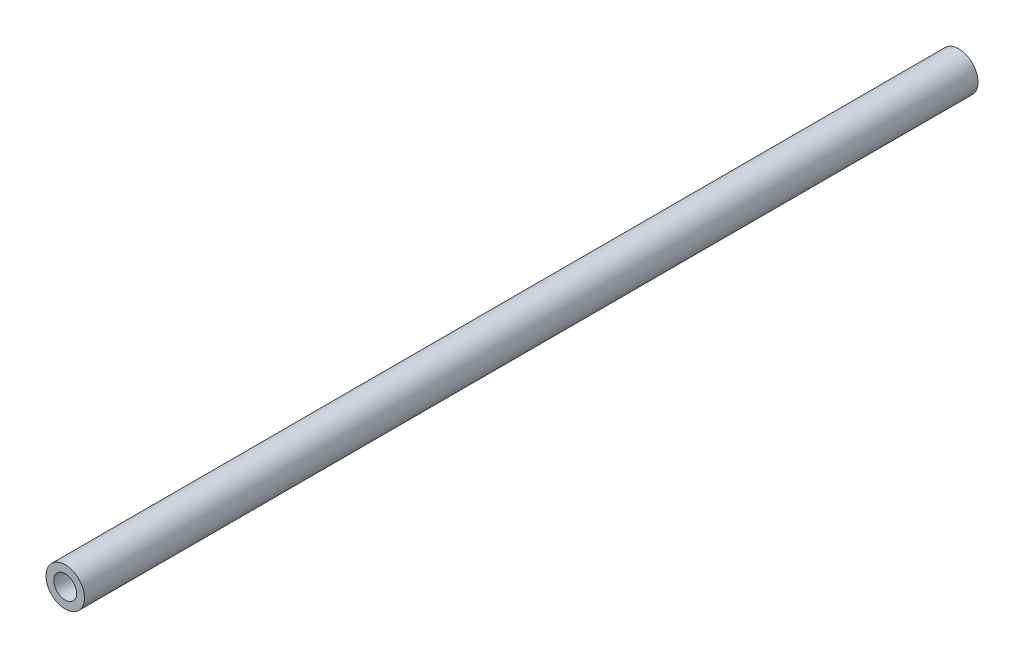
ISO-10303-21;
HEADER;
FILE_DESCRIPTION(('STEP AP214'),'2;1');
FILE_NAME('part.step','',(''),(''),'','','');
FILE_SCHEMA(('AUTOMOTIVE_DESIGN { 1 0 10303 214 1 1 1 1 }'));
ENDSEC;
DATA;
#1=APPLICATION_CONTEXT('core data for automotive mechanical design processes');
#2=APPLICATION_PROTOCOL_DEFINITION('international standard','automotive_design',2000,#1);
#3=PRODUCT_CONTEXT('',#1,'mechanical');
#4=PRODUCT('Part','Part','',(#3));
#5=PRODUCT_RELATED_PRODUCT_CATEGORY('part','',(#4));
#6=PRODUCT_DEFINITION_FORMATION('','',#4);
#7=PRODUCT_DEFINITION_CONTEXT('part definition',#1,'design');
#8=PRODUCT_DEFINITION('design','',#6,#7);
#9=PRODUCT_DEFINITION_SHAPE('','',#8);
#10=(LENGTH_UNIT() NAMED_UNIT(*) SI_UNIT(.MILLI.,.METRE.));
#11=(NAMED_UNIT(*) PLANE_ANGLE_UNIT() SI_UNIT($,.RADIAN.));
#12=(NAMED_UNIT(*) SI_UNIT($,.STERADIAN.) SOLID_ANGLE_UNIT());
#13=UNCERTAINTY_MEASURE_WITH_UNIT(LENGTH_MEASURE(1.E-05),#10,'distance_accuracy_value','');
#14=(GEOMETRIC_REPRESENTATION_CONTEXT(3) GLOBAL_UNCERTAINTY_ASSIGNED_CONTEXT((#13)) GLOBAL_UNIT_ASSIGNED_CONTEXT((#10,
#11,#12)) REPRESENTATION_CONTEXT('',''));
#15=CARTESIAN_POINT('',(0.,0.,0.));
#16=DIRECTION('',(0.,0.,1.));
#17=DIRECTION('',(1.,0.,0.));
#18=AXIS2_PLACEMENT_3D('',#15,#16,#17);
#19=CARTESIAN_POINT('',(0.,0.,366.7));
#20=DIRECTION('',(0.,0.,1.));
#21=DIRECTION('',(1.,0.,0.));
#22=AXIS2_PLACEMENT_3D('',#19,#20,#21);
#23=PLANE('',#22);
#24=CARTESIAN_POINT('',(0.,0.,366.7));
#25=DIRECTION('',(0.,0.,1.));
#26=DIRECTION('',(1.,0.,0.));
#27=AXIS2_PLACEMENT_3D('',#24,#25,#26);
#28=CIRCLE('',#27,7.9);
#29=CARTESIAN_POINT('',(7.9,0.,366.7));
#30=VERTEX_POINT('',#29);
#31=EDGE_CURVE('E10',#30,#30,#28,.T.);
#32=ORIENTED_EDGE('',*,*,#31,.T.);
#33=EDGE_LOOP('',(#32));
#34=FACE_BOUND('',#33,.T.);
#35=CARTESIAN_POINT('',(0.,0.,366.7));
#36=DIRECTION('',(0.,0.,1.));
#37=DIRECTION('',(1.,0.,0.));
#38=AXIS2_PLACEMENT_3D('',#35,#36,#37);
#39=CIRCLE('',#38,4.7);
#40=CARTESIAN_POINT('',(4.7,0.,366.7));
#41=VERTEX_POINT('',#40);
#42=EDGE_CURVE('E44',#41,#41,#39,.T.);
#43=ORIENTED_EDGE('',*,*,#42,.F.);
#44=EDGE_LOOP('',(#43));
#45=FACE_BOUND('',#44,.T.);
#46=ADVANCED_FACE('F33',(#34,#45),#23,.T.);
#47=CARTESIAN_POINT('',(0.,0.,0.));
#48=DIRECTION('',(0.,0.,1.));
#49=DIRECTION('',(1.,0.,0.));
#50=AXIS2_PLACEMENT_3D('',#47,#48,#49);
#51=PLANE('',#50);
#52=CARTESIAN_POINT('',(0.,0.,0.));
#53=DIRECTION('',(0.,0.,1.));
#54=DIRECTION('',(1.,0.,0.));
#55=AXIS2_PLACEMENT_3D('',#52,#53,#54);
#56=CIRCLE('',#55,7.9);
#57=CARTESIAN_POINT('',(7.9,0.,0.));
#58=VERTEX_POINT('',#57);
#59=EDGE_CURVE('E37',#58,#58,#56,.T.);
#60=ORIENTED_EDGE('',*,*,#59,.F.);
#61=EDGE_LOOP('',(#60));
#62=FACE_BOUND('',#61,.T.);
#63=CARTESIAN_POINT('',(0.,0.,0.));
#64=DIRECTION('',(0.,0.,1.));
#65=DIRECTION('',(1.,0.,0.));
#66=AXIS2_PLACEMENT_3D('',#63,#64,#65);
#67=CIRCLE('',#66,4.7);
#68=CARTESIAN_POINT('',(4.7,0.,0.));
#69=VERTEX_POINT('',#68);
#70=EDGE_CURVE('E46',#69,#69,#67,.T.);
#71=ORIENTED_EDGE('',*,*,#70,.T.);
#72=EDGE_LOOP('',(#71));
#73=FACE_BOUND('',#72,.T.);
#74=ADVANCED_FACE('F56',(#62,#73),#51,.F.);
#75=CARTESIAN_POINT('',(0.,0.,366.7));
#76=DIRECTION('',(0.,0.,-1.));
#77=DIRECTION('',(-1.,0.,0.));
#78=AXIS2_PLACEMENT_3D('',#75,#76,#77);
#79=CYLINDRICAL_SURFACE('',#78,7.9);
#80=ORIENTED_EDGE('',*,*,#31,.F.);
#81=EDGE_LOOP('',(#80));
#82=FACE_BOUND('',#81,.T.);
#83=ORIENTED_EDGE('',*,*,#59,.T.);
#84=EDGE_LOOP('',(#83));
#85=FACE_BOUND('',#84,.T.);
#86=ADVANCED_FACE('F35',(#82,#85),#79,.T.);
#87=CARTESIAN_POINT('',(0.,0.,366.7));
#88=DIRECTION('',(0.,0.,-1.));
#89=DIRECTION('',(-1.,0.,0.));
#90=AXIS2_PLACEMENT_3D('',#87,#88,#89);
#91=CYLINDRICAL_SURFACE('',#90,4.7);
#92=ORIENTED_EDGE('',*,*,#42,.T.);
#93=EDGE_LOOP('',(#92));
#94=FACE_BOUND('',#93,.T.);
#95=ORIENTED_EDGE('',*,*,#70,.F.);
#96=EDGE_LOOP('',(#95));
#97=FACE_BOUND('',#96,.T.);
#98=ADVANCED_FACE('F52',(#94,#97),#91,.F.);
#99=CLOSED_SHELL('',(#46,#74,#86,#98));
#100=MANIFOLD_SOLID_BREP('B2',#99);
#101=ADVANCED_BREP_SHAPE_REPRESENTATION('',(#18,#100),#14);
#102=SHAPE_DEFINITION_REPRESENTATION(#9,#101);
ENDSEC;
END-ISO-10303-21;
